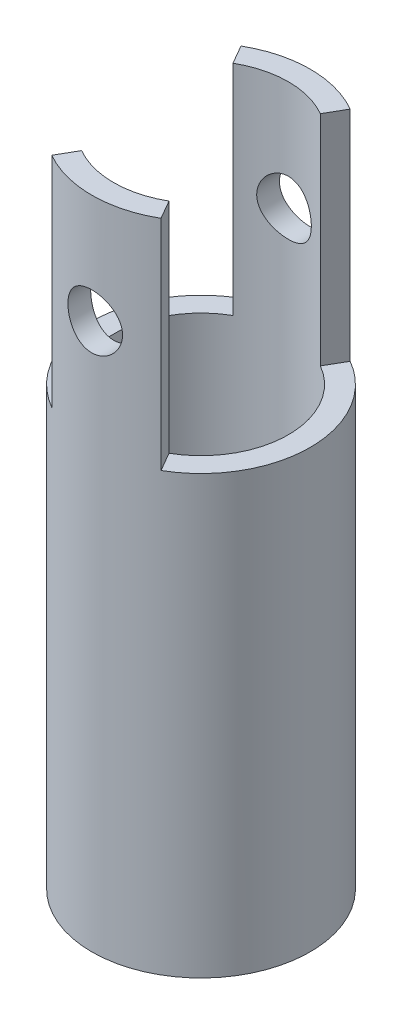
ISO-10303-21;
HEADER;
FILE_DESCRIPTION(('STEP AP214'),'2;1');
FILE_NAME('part.step','',(''),(''),'','','');
FILE_SCHEMA(('AUTOMOTIVE_DESIGN { 1 0 10303 214 1 1 1 1 }'));
ENDSEC;
DATA;
#1=APPLICATION_CONTEXT('core data for automotive mechanical design processes');
#2=APPLICATION_PROTOCOL_DEFINITION('international standard','automotive_design',2000,#1);
#3=PRODUCT_CONTEXT('',#1,'mechanical');
#4=PRODUCT('Part','Part','',(#3));
#5=PRODUCT_RELATED_PRODUCT_CATEGORY('part','',(#4));
#6=PRODUCT_DEFINITION_FORMATION('','',#4);
#7=PRODUCT_DEFINITION_CONTEXT('part definition',#1,'design');
#8=PRODUCT_DEFINITION('design','',#6,#7);
#9=PRODUCT_DEFINITION_SHAPE('','',#8);
#10=(LENGTH_UNIT() NAMED_UNIT(*) SI_UNIT(.MILLI.,.METRE.));
#11=(NAMED_UNIT(*) PLANE_ANGLE_UNIT() SI_UNIT($,.RADIAN.));
#12=(NAMED_UNIT(*) SI_UNIT($,.STERADIAN.) SOLID_ANGLE_UNIT());
#13=UNCERTAINTY_MEASURE_WITH_UNIT(LENGTH_MEASURE(1.E-05),#10,'distance_accuracy_value','');
#14=(GEOMETRIC_REPRESENTATION_CONTEXT(3) GLOBAL_UNCERTAINTY_ASSIGNED_CONTEXT((#13)) GLOBAL_UNIT_ASSIGNED_CONTEXT((#10,
#11,#12)) REPRESENTATION_CONTEXT('',''));
#15=CARTESIAN_POINT('',(0.,0.,0.));
#16=DIRECTION('',(0.,0.,1.));
#17=DIRECTION('',(1.,0.,0.));
#18=AXIS2_PLACEMENT_3D('',#15,#16,#17);
#19=CARTESIAN_POINT('',(0.,6.,0.));
#20=DIRECTION('',(0.,-1.,0.));
#21=DIRECTION('',(0.,0.,-1.));
#22=AXIS2_PLACEMENT_3D('',#19,#20,#21);
#23=CYLINDRICAL_SURFACE('',#22,1.);
#24=CARTESIAN_POINT('',(0.,0.,0.));
#25=DIRECTION('',(0.,1.,0.));
#26=DIRECTION('',(0.,0.,1.));
#27=AXIS2_PLACEMENT_3D('',#24,#25,#26);
#28=CIRCLE('',#27,1.);
#29=CARTESIAN_POINT('',(0.,0.,1.));
#30=VERTEX_POINT('',#29);
#31=EDGE_CURVE('E175',#30,#30,#28,.T.);
#32=ORIENTED_EDGE('',*,*,#31,.T.);
#33=EDGE_LOOP('',(#32));
#34=FACE_BOUND('',#33,.T.);
#35=CARTESIAN_POINT('',(0.,4.,0.));
#36=DIRECTION('',(0.,1.,0.));
#37=DIRECTION('',(0.,0.,1.));
#38=AXIS2_PLACEMENT_3D('',#35,#36,#37);
#39=CIRCLE('',#38,1.);
#40=CARTESIAN_POINT('',(0.500000000000001,4.,0.866025403784438));
#41=VERTEX_POINT('',#40);
#42=CARTESIAN_POINT('',(0.500000000000001,4.,-0.866025403784438));
#43=VERTEX_POINT('',#42);
#44=EDGE_CURVE('E127',#41,#43,#39,.T.);
#45=ORIENTED_EDGE('',*,*,#44,.F.);
#46=DIRECTION('',(0.,1.,0.));
#47=VECTOR('',#46,1.);
#48=CARTESIAN_POINT('',(0.500000000000001,4.,0.866025403784438));
#49=LINE('',#48,#47);
#50=CARTESIAN_POINT('',(0.500000000000001,6.,0.866025403784438));
#51=VERTEX_POINT('',#50);
#52=EDGE_CURVE('E135',#41,#51,#49,.T.);
#53=ORIENTED_EDGE('',*,*,#52,.T.);
#54=CARTESIAN_POINT('',(0.,6.,0.));
#55=DIRECTION('',(0.,1.,0.));
#56=DIRECTION('',(0.,0.,1.));
#57=AXIS2_PLACEMENT_3D('',#54,#55,#56);
#58=CIRCLE('',#57,1.);
#59=CARTESIAN_POINT('',(-0.500000000000001,6.,0.866025403784438));
#60=VERTEX_POINT('',#59);
#61=EDGE_CURVE('E179',#60,#51,#58,.T.);
#62=ORIENTED_EDGE('',*,*,#61,.F.);
#63=DIRECTION('',(0.,1.,0.));
#64=VECTOR('',#63,1.);
#65=CARTESIAN_POINT('',(-0.500000000000001,4.,0.866025403784438));
#66=LINE('',#65,#64);
#67=CARTESIAN_POINT('',(-0.500000000000001,4.,0.866025403784438));
#68=VERTEX_POINT('',#67);
#69=EDGE_CURVE('E167',#68,#60,#66,.T.);
#70=ORIENTED_EDGE('',*,*,#69,.F.);
#71=CARTESIAN_POINT('',(0.,4.,0.));
#72=DIRECTION('',(0.,1.,0.));
#73=DIRECTION('',(0.,0.,1.));
#74=AXIS2_PLACEMENT_3D('',#71,#72,#73);
#75=CIRCLE('',#74,1.);
#76=CARTESIAN_POINT('',(-0.500000000000001,4.,-0.866025403784438));
#77=VERTEX_POINT('',#76);
#78=EDGE_CURVE('E159',#77,#68,#75,.T.);
#79=ORIENTED_EDGE('',*,*,#78,.F.);
#80=DIRECTION('',(0.,1.,0.));
#81=VECTOR('',#80,1.);
#82=CARTESIAN_POINT('',(-0.500000000000001,4.,-0.866025403784438));
#83=LINE('',#82,#81);
#84=CARTESIAN_POINT('',(-0.500000000000001,6.,-0.866025403784438));
#85=VERTEX_POINT('',#84);
#86=EDGE_CURVE('E163',#77,#85,#83,.T.);
#87=ORIENTED_EDGE('',*,*,#86,.T.);
#88=CARTESIAN_POINT('',(0.500000000000001,6.,-0.866025403784438));
#89=VERTEX_POINT('',#88);
#90=EDGE_CURVE('E182',#89,#85,#58,.T.);
#91=ORIENTED_EDGE('',*,*,#90,.F.);
#92=DIRECTION('',(0.,1.,0.));
#93=VECTOR('',#92,1.);
#94=CARTESIAN_POINT('',(0.500000000000001,4.,-0.866025403784438));
#95=LINE('',#94,#93);
#96=EDGE_CURVE('E142',#43,#89,#95,.T.);
#97=ORIENTED_EDGE('',*,*,#96,.F.);
#98=EDGE_LOOP('',(#45,#53,#62,#70,#79,#87,#91,#97));
#99=FACE_BOUND('',#98,.T.);
#100=CARTESIAN_POINT('',(-0.25,5.,0.968245836551854));
#101=CARTESIAN_POINT('',(-0.249999607859675,4.9861949249108,0.968246100142962));
#102=CARTESIAN_POINT('',(-0.248852624552017,4.97238551014216,0.968544306248196));
#103=CARTESIAN_POINT('',(-0.244302312548611,4.94516324219185,0.969701862230623));
#104=CARTESIAN_POINT('',(-0.240897670674519,4.93175062455501,0.970561538685451));
#105=CARTESIAN_POINT('',(-0.231949119962409,4.90571964617804,0.97273872453253));
#106=CARTESIAN_POINT('',(-0.226407972785236,4.89310028446056,0.974055642673399));
#107=CARTESIAN_POINT('',(-0.213352114126352,4.86896891474688,0.976998192045818));
#108=CARTESIAN_POINT('',(-0.205837318856126,4.85745695379221,0.978623836383102));
#109=CARTESIAN_POINT('',(-0.188870842731129,4.83561383547354,0.982040716350921));
#110=CARTESIAN_POINT('',(-0.179383688770389,4.82531063996493,0.983834597621773));
#111=CARTESIAN_POINT('',(-0.158818206410081,4.80642386056403,0.987362875516555));
#112=CARTESIAN_POINT('',(-0.147739729418034,4.79784043743784,0.989097266566729));
#113=CARTESIAN_POINT('',(-0.124114520107891,4.78252245323685,0.992340415520238));
#114=CARTESIAN_POINT('',(-0.11154945761951,4.77581536118385,0.9938456874005));
#115=CARTESIAN_POINT('',(-0.0854263184292768,4.7646190355847,0.996430811926076));
#116=CARTESIAN_POINT('',(-0.0718683885791937,4.76012947480845,0.997510727334369));
#117=CARTESIAN_POINT('',(-0.0444358758754152,4.75358521654214,0.999104758848156));
#118=CARTESIAN_POINT('',(-0.0305732719548969,4.75148303556734,0.999629893844308));
#119=CARTESIAN_POINT('',(-0.00268288192627664,4.74962416207245,1.0000935941073));
#120=CARTESIAN_POINT('',(0.0113448794538072,4.74986712277904,1.00003224609671));
#121=CARTESIAN_POINT('',(0.038838061793097,4.75265748502501,0.999338094953533));
#122=CARTESIAN_POINT('',(0.0523090539002668,4.75515363250539,0.998718002340874));
#123=CARTESIAN_POINT('',(0.0786345618534216,4.76229712700485,0.996990836524855));
#124=CARTESIAN_POINT('',(0.0914890448426097,4.76694458853774,0.995883737398441));
#125=CARTESIAN_POINT('',(0.116351675875452,4.77830025706871,0.993287509700895));
#126=CARTESIAN_POINT('',(0.128351127441626,4.78502670446618,0.991795019695053));
#127=CARTESIAN_POINT('',(0.151068905585122,4.80033556791163,0.988589903809649));
#128=CARTESIAN_POINT('',(0.161787008771377,4.80891830685606,0.98687723965249));
#129=CARTESIAN_POINT('',(0.18194350877124,4.82797087419824,0.98336371376952));
#130=CARTESIAN_POINT('',(0.1913394197688,4.83848548923478,0.981561719525917));
#131=CARTESIAN_POINT('',(0.208244093990755,4.86095999735403,0.978115043516706));
#132=CARTESIAN_POINT('',(0.215752769011505,4.8729199579491,0.97647036910597));
#133=CARTESIAN_POINT('',(0.22869703225565,4.8980290034149,0.973520496831648));
#134=CARTESIAN_POINT('',(0.234122391742623,4.91118357303132,0.97221698372572));
#135=CARTESIAN_POINT('',(0.242671405159085,4.93825854680765,0.970118640139957));
#136=CARTESIAN_POINT('',(0.245795551638228,4.95217878639831,0.969323700810218));
#137=CARTESIAN_POINT('',(0.249582963866518,4.97999595015231,0.968355356039141));
#138=CARTESIAN_POINT('',(0.250309047391963,4.99388377933296,0.968166089093648));
#139=CARTESIAN_POINT('',(0.249451699051555,5.02158219365782,0.968387343481039));
#140=CARTESIAN_POINT('',(0.24786847978488,5.03539278579512,0.968797809601266));
#141=CARTESIAN_POINT('',(0.242492546393766,5.06231142649547,0.97015708195456));
#142=CARTESIAN_POINT('',(0.238736406828175,5.07542727265708,0.971096970234375));
#143=CARTESIAN_POINT('',(0.229161808167062,5.10084314578517,0.973400718270962));
#144=CARTESIAN_POINT('',(0.223343104771255,5.11314307590553,0.974764628248613));
#145=CARTESIAN_POINT('',(0.209677066793656,5.13684412778673,0.977796137093263));
#146=CARTESIAN_POINT('',(0.201792175383563,5.14822288400431,0.979469168606642));
#147=CARTESIAN_POINT('',(0.184265073233614,5.16951883628013,0.982917083071716));
#148=CARTESIAN_POINT('',(0.17462257370136,5.17943579166501,0.98469198272847));
#149=CARTESIAN_POINT('',(0.153565680246182,5.1977811042571,0.988197403031606));
#150=CARTESIAN_POINT('',(0.142112988132898,5.20616600625488,0.989925702061836));
#151=CARTESIAN_POINT('',(0.117925670673669,5.22089358669512,0.993097216613734));
#152=CARTESIAN_POINT('',(0.105191112239398,5.22723637166082,0.99454044700396));
#153=CARTESIAN_POINT('',(0.0788895504327728,5.23764460345279,0.996970115738314));
#154=CARTESIAN_POINT('',(0.0653293452569706,5.24172642843791,0.99795983002241));
#155=CARTESIAN_POINT('',(0.0376874400797021,5.24754603346084,0.999385293395788));
#156=CARTESIAN_POINT('',(0.0236058412603111,5.24928426587391,0.999821149393409));
#157=CARTESIAN_POINT('',(-0.00427088161083149,5.25034189739388,1.00008542352203));
#158=CARTESIAN_POINT('',(-0.0180634567415082,5.24972542727385,0.999929947200021));
#159=CARTESIAN_POINT('',(-0.0453418741036848,5.24623804317642,0.999064741143559));
#160=CARTESIAN_POINT('',(-0.0588277254452216,5.24336719624672,0.998355027892736));
#161=CARTESIAN_POINT('',(-0.085042758911204,5.23548694505727,0.996463582134908));
#162=CARTESIAN_POINT('',(-0.0977756236452547,5.23048913667134,0.995284411256671));
#163=CARTESIAN_POINT('',(-0.122229263260367,5.21850735524517,0.992578222283454));
#164=CARTESIAN_POINT('',(-0.133949910316263,5.21152313183261,0.991051160344318));
#165=CARTESIAN_POINT('',(-0.156350482105974,5.19557119150073,0.987768124203356));
#166=CARTESIAN_POINT('',(-0.166998747075146,5.18655996427316,0.986007542364116));
#167=CARTESIAN_POINT('',(-0.186653755067812,5.16689428700655,0.982476622633017));
#168=CARTESIAN_POINT('',(-0.195660081267044,5.15623942097552,0.98070628238106));
#169=CARTESIAN_POINT('',(-0.21194050661981,5.13334964644968,0.977318689651707));
#170=CARTESIAN_POINT('',(-0.219179154861648,5.12108896914688,0.975704909325977));
#171=CARTESIAN_POINT('',(-0.231481724153905,5.09548612751929,0.972859888875275));
#172=CARTESIAN_POINT('',(-0.236547227439889,5.08214475847318,0.971628370612036));
#173=CARTESIAN_POINT('',(-0.243605632141393,5.05735574704343,0.969879771853287));
#174=CARTESIAN_POINT('',(-0.245998292648957,5.04602670890441,0.969271657514403));
#175=CARTESIAN_POINT('',(-0.249195573143205,5.02313278274963,0.968454596450895));
#176=CARTESIAN_POINT('',(-0.25000032859263,5.01156791493734,0.968245615676597));
#177=CARTESIAN_POINT('',(-0.25,5.,0.968245836551854));
#178=B_SPLINE_CURVE_WITH_KNOTS('',3,(#100,#101,#102,#103,#104,#105,#106,#107,#108,#109,#110,
#111,#112,#113,#114,#115,#116,#117,#118,#119,#120,#121,#122,#123,#124,#125,#126,#127,#128,#129,
#130,#131,#132,#133,#134,#135,#136,#137,#138,#139,#140,#141,#142,#143,#144,#145,#146,#147,#148,
#149,#150,#151,#152,#153,#154,#155,#156,#157,#158,#159,#160,#161,#162,#163,#164,#165,#166,#167,
#168,#169,#170,#171,#172,#173,#174,#175,#176,#177),.UNSPECIFIED.,.T.,.F.,(4,2,2,2,2,2,2,2,2,2,2,
2,2,2,2,2,2,2,2,2,2,2,2,2,2,2,2,2,2,2,2,2,2,2,2,2,2,2,4),(0.,0.0413727441688085,
0.0827695741335529,0.124113072707288,0.165458326746165,0.207623954183663,0.249793521470553,
0.292551496388607,0.335303159837779,0.377188750986033,0.419068148656707,0.460018262679633,
0.500970556715472,0.542292874245131,0.5836223854596,0.626070466562599,0.66852053119049,
0.71117643199909,0.753823200120234,0.795343574752405,0.836860127174489,0.877697404999894,
0.918539521412104,0.960182845849844,1.00183301887573,1.04452533095601,1.08721541571024,
1.12959207279762,1.17196054889972,1.21318344611814,1.25440511736767,1.2954048765504,
1.33640980572876,1.37839709657276,1.4203950315562,1.46317647727536,1.50592672135731,
1.54059782716802,1.57526597509021),.UNSPECIFIED.);
#179=CARTESIAN_POINT('',(-0.25,5.,0.968245836551854));
#180=VERTEX_POINT('',#179);
#181=EDGE_CURVE('E213',#180,#180,#178,.T.);
#182=ORIENTED_EDGE('',*,*,#181,.F.);
#183=EDGE_LOOP('',(#182));
#184=FACE_BOUND('',#183,.T.);
#185=CARTESIAN_POINT('',(0.,5.25,-1.));
#186=CARTESIAN_POINT('',(0.0138126814449552,5.24999961237697,-0.999999766446688));
#187=CARTESIAN_POINT('',(0.027629692971794,5.24885140820437,-0.999710963553047));
#188=CARTESIAN_POINT('',(0.0548677206284222,5.2442958081155,-0.998586856383154));
#189=CARTESIAN_POINT('',(0.0682885078117899,5.24088713174369,-0.997751242366614));
#190=CARTESIAN_POINT('',(0.0943368120304296,5.23192679108965,-0.995626043886733));
#191=CARTESIAN_POINT('',(0.106965260571667,5.22637770021412,-0.994337004736811));
#192=CARTESIAN_POINT('',(0.131112021984071,5.21330310165919,-0.991442239679322));
#193=CARTESIAN_POINT('',(0.14263029739146,5.20577752731351,-0.989836503090084));
#194=CARTESIAN_POINT('',(0.164466987883487,5.18879986839096,-0.986445689319669));
#195=CARTESIAN_POINT('',(0.174759281676845,5.1793147375068,-0.984657845247555));
#196=CARTESIAN_POINT('',(0.193624821200551,5.15875796584851,-0.981122700195882));
#197=CARTESIAN_POINT('',(0.202197872824856,5.14768614617558,-0.979375403813914));
#198=CARTESIAN_POINT('',(0.217504423799839,5.12406746221043,-0.97609129283285));
#199=CARTESIAN_POINT('',(0.224208702654226,5.11150112819827,-0.974557990784342));
#200=CARTESIAN_POINT('',(0.235399484758421,5.08537526472361,-0.971915824687039));
#201=CARTESIAN_POINT('',(0.239886342573222,5.07181589444571,-0.970806892787981));
#202=CARTESIAN_POINT('',(0.246425806134049,5.04437608363292,-0.969167461195918));
#203=CARTESIAN_POINT('',(0.248525378055557,5.03050751732503,-0.968625818459043));
#204=CARTESIAN_POINT('',(0.250376962511309,5.00260523849767,-0.968148937562901));
#205=CARTESIAN_POINT('',(0.250129356969663,4.9885715532169,-0.96821360074774));
#206=CARTESIAN_POINT('',(0.24733108743988,4.96109736537592,-0.96893200916103));
#207=CARTESIAN_POINT('',(0.244836390031753,4.94765072975582,-0.969571438336465));
#208=CARTESIAN_POINT('',(0.237704031150518,4.92137315818145,-0.971344516127473));
#209=CARTESIAN_POINT('',(0.233066217011571,4.90854226616184,-0.972478199951161));
#210=CARTESIAN_POINT('',(0.221731579656192,4.88371033062466,-0.975125189840311));
#211=CARTESIAN_POINT('',(0.215014444538819,4.87171897136841,-0.976642212449035));
#212=CARTESIAN_POINT('',(0.199726046002492,4.84901354837386,-0.979882851410643));
#213=CARTESIAN_POINT('',(0.191154458134806,4.83829970865546,-0.981606503891225));
#214=CARTESIAN_POINT('',(0.172110570780203,4.8181327307176,-0.985126467566302));
#215=CARTESIAN_POINT('',(0.161591043027643,4.80872425165644,-0.986923449129952));
#216=CARTESIAN_POINT('',(0.139101986250617,4.79179645958935,-0.990343275964643));
#217=CARTESIAN_POINT('',(0.127132412951324,4.78427720428941,-0.991966115915692));
#218=CARTESIAN_POINT('',(0.102019314780232,4.77132490229594,-0.994862886823637));
#219=CARTESIAN_POINT('',(0.088871898868104,4.7658991099576,-0.996135600212875));
#220=CARTESIAN_POINT('',(0.0618126680238139,4.75734711571507,-0.998179861652364));
#221=CARTESIAN_POINT('',(0.0479009998584143,4.75422047393031,-0.998951505565468));
#222=CARTESIAN_POINT('',(0.0200899950650046,4.75042373907353,-0.999892498785624));
#223=CARTESIAN_POINT('',(0.00619945333136843,4.74969282898745,-1.00007675584713));
#224=CARTESIAN_POINT('',(-0.0215054791335846,4.75054150034258,-0.999864674690751));
#225=CARTESIAN_POINT('',(-0.0353198766074325,4.75212087379986,-0.999468388736411));
#226=CARTESIAN_POINT('',(-0.0622690447960818,4.75749515139856,-0.998149301878928));
#227=CARTESIAN_POINT('',(-0.0754108531614589,4.76125687724616,-0.997234390309685));
#228=CARTESIAN_POINT('',(-0.100876215408752,4.77085118067141,-0.994981177723557));
#229=CARTESIAN_POINT('',(-0.113199686505439,4.77668396738553,-0.99364283394982));
#230=CARTESIAN_POINT('',(-0.136920522404974,4.79037268814579,-0.990655513210517));
#231=CARTESIAN_POINT('',(-0.148297573639305,4.79826268539946,-0.989001445611553));
#232=CARTESIAN_POINT('',(-0.169587768940541,4.81579831813283,-0.985574181979032));
#233=CARTESIAN_POINT('',(-0.179500659828835,4.82544425660282,-0.983800965419508));
#234=CARTESIAN_POINT('',(-0.197831761345455,4.84650032680741,-0.980281594934618));
#235=CARTESIAN_POINT('',(-0.206207311270339,4.8579479505004,-0.978537173645468));
#236=CARTESIAN_POINT('',(-0.22091845983545,4.88212210574429,-0.975321463962064));
#237=CARTESIAN_POINT('',(-0.227254149026323,4.89484858049329,-0.973850163445043));
#238=CARTESIAN_POINT('',(-0.237658570101548,4.92115095373551,-0.971363491224442));
#239=CARTESIAN_POINT('',(-0.241740732775677,4.93472127139067,-0.970345425486509));
#240=CARTESIAN_POINT('',(-0.247557609992296,4.96238493964818,-0.968877906816972));
#241=CARTESIAN_POINT('',(-0.249292837913109,4.97647817517208,-0.968428329533227));
#242=CARTESIAN_POINT('',(-0.250339765055666,5.00435350397587,-0.968158168673261));
#243=CARTESIAN_POINT('',(-0.24971964963002,5.01813290585412,-0.968319887880439));
#244=CARTESIAN_POINT('',(-0.246229546385478,5.04538398144466,-0.969213181679738));
#245=CARTESIAN_POINT('',(-0.243359603781128,5.05885566133561,-0.969944744819761));
#246=CARTESIAN_POINT('',(-0.235488553240466,5.08503474317757,-0.971885434471204));
#247=CARTESIAN_POINT('',(-0.230500234113396,5.09774621754003,-0.973091692060516));
#248=CARTESIAN_POINT('',(-0.218544152267512,5.12216089711895,-0.975846259541381));
#249=CARTESIAN_POINT('',(-0.211576115005698,5.13386396219782,-0.977394616867955));
#250=CARTESIAN_POINT('',(-0.195644624772856,5.15625910483367,-0.980709390439187));
#251=CARTESIAN_POINT('',(-0.186633860485376,5.16691684557066,-0.982480441386262));
#252=CARTESIAN_POINT('',(-0.166964895198289,5.18659117413257,-0.98601337874381));
#253=CARTESIAN_POINT('',(-0.156306303543524,5.19560737168549,-0.987775262878433));
#254=CARTESIAN_POINT('',(-0.133411264450431,5.21190188476077,-0.991129426079438));
#255=CARTESIAN_POINT('',(-0.121149737052731,5.21914576894526,-0.99271805560978));
#256=CARTESIAN_POINT('',(-0.0955443432517457,5.23145791049009,-0.995508208291864));
#257=CARTESIAN_POINT('',(-0.0822012605727898,5.23652772677476,-0.996710008666302));
#258=CARTESIAN_POINT('',(-0.0574017088739119,5.24359530505494,-0.998413432609236));
#259=CARTESIAN_POINT('',(-0.0460633618180113,5.24599187384224,-0.999004308421151));
#260=CARTESIAN_POINT('',(-0.0231510119227137,5.24919432393699,-0.99979767538658));
#261=CARTESIAN_POINT('',(-0.0115770268737693,5.25000032488422,-1.00000019575149));
#262=CARTESIAN_POINT('',(0.,5.25,-1.));
#263=B_SPLINE_CURVE_WITH_KNOTS('',3,(#185,#186,#187,#188,#189,#190,#191,#192,#193,#194,#195,
#196,#197,#198,#199,#200,#201,#202,#203,#204,#205,#206,#207,#208,#209,#210,#211,#212,#213,#214,
#215,#216,#217,#218,#219,#220,#221,#222,#223,#224,#225,#226,#227,#228,#229,#230,#231,#232,#233,
#234,#235,#236,#237,#238,#239,#240,#241,#242,#243,#244,#245,#246,#247,#248,#249,#250,#251,#252,
#253,#254,#255,#256,#257,#258,#259,#260,#261,#262),.UNSPECIFIED.,.T.,.F.,(4,2,2,2,2,2,2,2,2,2,2,
2,2,2,2,2,2,2,2,2,2,2,2,2,2,2,2,2,2,2,2,2,2,2,2,2,2,2,4),(0.,0.041395618745315,
0.0828147062939834,0.124184150381018,0.165554990028221,0.207690725728565,0.24983121596677,
0.292597745909678,0.33535743528228,0.377260491832385,0.419156730187829,0.460037495011697,
0.500921172443397,0.542217546456466,0.583521151393605,0.626002501615033,0.668485149263745,
0.71111371501519,0.753734122814405,0.795263848248794,0.836789835187905,0.877700457523396,
0.918615212203818,0.960255979275587,1.0019039383467,1.04457418200746,1.08724253124918,
1.12965375769006,1.17205570542068,1.21323963399769,1.25442273492672,1.29536066759908,
1.33630428022817,1.37831596068318,1.42033761628403,1.46312030916598,1.50587227303558,
1.54057040490358,1.5752659267384),.UNSPECIFIED.);
#264=CARTESIAN_POINT('',(0.,5.25,-1.));
#265=VERTEX_POINT('',#264);
#266=EDGE_CURVE('E152',#265,#265,#263,.T.);
#267=ORIENTED_EDGE('',*,*,#266,.F.);
#268=EDGE_LOOP('',(#267));
#269=FACE_BOUND('',#268,.T.);
#270=ADVANCED_FACE('F54',(#34,#99,#184,#269),#23,.T.);
#271=CARTESIAN_POINT('',(0.,6.,0.));
#272=DIRECTION('',(0.,-1.,0.));
#273=DIRECTION('',(0.,0.,-1.));
#274=AXIS2_PLACEMENT_3D('',#271,#272,#273);
#275=CYLINDRICAL_SURFACE('',#274,0.8);
#276=CARTESIAN_POINT('',(-0.25,5.,0.759934207678533));
#277=CARTESIAN_POINT('',(-0.249999907560863,4.9863305927824,0.759934291986101));
#278=CARTESIAN_POINT('',(-0.24887507758624,4.97266024627195,0.760307063246376));
#279=CARTESIAN_POINT('',(-0.244418350805771,4.94572116783604,0.761751278234757));
#280=CARTESIAN_POINT('',(-0.241085857565507,4.93245254545588,0.762822910769838));
#281=CARTESIAN_POINT('',(-0.232339576446039,4.90671101960952,0.765531877608653));
#282=CARTESIAN_POINT('',(-0.226929471473064,4.89423675337777,0.767168210371662));
#283=CARTESIAN_POINT('',(-0.214193828346603,4.87036946082829,0.770820812454351));
#284=CARTESIAN_POINT('',(-0.206867951811343,4.85897662600827,0.772837148876294));
#285=CARTESIAN_POINT('',(-0.190239214124378,4.837204226501,0.777100255332483));
#286=CARTESIAN_POINT('',(-0.180881879944058,4.82686727811272,0.779352246768285));
#287=CARTESIAN_POINT('',(-0.160572409291121,4.80788079735825,0.783788491721947));
#288=CARTESIAN_POINT('',(-0.149620050503719,4.79923150061105,0.7859727357456));
#289=CARTESIAN_POINT('',(-0.126125182498666,4.78367778739773,0.790087106779803));
#290=CARTESIAN_POINT('',(-0.113552311304018,4.7768172592337,0.792010369125465));
#291=CARTESIAN_POINT('',(-0.0873608465706826,4.7653247900289,0.795325103666132));
#292=CARTESIAN_POINT('',(-0.0737424996974111,4.76069232517009,0.796716700839864));
#293=CARTESIAN_POINT('',(-0.0462928713932195,4.75392977438058,0.798774351641701));
#294=CARTESIAN_POINT('',(-0.0324811430936433,4.75172685004243,0.79946147796828));
#295=CARTESIAN_POINT('',(-0.00466816279690461,4.74965513071249,0.800107191752036));
#296=CARTESIAN_POINT('',(0.00933304539461623,4.74978580512823,0.80006594482013));
#297=CARTESIAN_POINT('',(0.0366148960709466,4.75232965831719,0.799274232265074));
#298=CARTESIAN_POINT('',(0.0499037268628085,4.7546638767026,0.798548301944321));
#299=CARTESIAN_POINT('',(0.0758906126695538,4.7614189980086,0.796498965121704));
#300=CARTESIAN_POINT('',(0.0885886290962388,4.76584003701731,0.795175519654244));
#301=CARTESIAN_POINT('',(0.113215620630956,4.77669403781498,0.79204691945909));
#302=CARTESIAN_POINT('',(0.125133281124566,4.78315096171261,0.790236067234006));
#303=CARTESIAN_POINT('',(0.147740502230406,4.79787421994091,0.786323445907032));
#304=CARTESIAN_POINT('',(0.158429751241767,4.80614101182756,0.784221603288827));
#305=CARTESIAN_POINT('',(0.178747539690776,4.82465472696026,0.779847341469648));
#306=CARTESIAN_POINT('',(0.188313309818837,4.83496981376825,0.77757146397952));
#307=CARTESIAN_POINT('',(0.205597948519073,4.85707902036488,0.773181230879473));
#308=CARTESIAN_POINT('',(0.213316599550676,4.86887331411494,0.771066894314638));
#309=CARTESIAN_POINT('',(0.226760930039538,4.89378349377203,0.767221693303059));
#310=CARTESIAN_POINT('',(0.232463361405391,4.90691268180869,0.765495380727824));
#311=CARTESIAN_POINT('',(0.241556691897,4.93401189837885,0.762675090658657));
#312=CARTESIAN_POINT('',(0.244948421531488,4.94798162284129,0.76158088599503));
#313=CARTESIAN_POINT('',(0.24920297037117,4.97576399051171,0.760199126852538));
#314=CARTESIAN_POINT('',(0.250161908707454,4.98956039924474,0.759880933031047));
#315=CARTESIAN_POINT('',(0.249793488996631,5.01711794829912,0.760002155178332));
#316=CARTESIAN_POINT('',(0.248466484222632,5.03087909374098,0.760441454083045));
#317=CARTESIAN_POINT('',(0.243649747026171,5.05756165933161,0.761997914901524));
#318=CARTESIAN_POINT('',(0.240223662321045,5.07049585481514,0.763095108186237));
#319=CARTESIAN_POINT('',(0.231380747322086,5.09560435839886,0.765822574680551));
#320=CARTESIAN_POINT('',(0.225963592342318,5.10777854218414,0.767452934829453));
#321=CARTESIAN_POINT('',(0.213115021311741,5.13140782195445,0.7711210793015));
#322=CARTESIAN_POINT('',(0.205630294977113,5.14283228311858,0.773169206978175));
#323=CARTESIAN_POINT('',(0.188921281735965,5.16429806927236,0.777420697946948));
#324=CARTESIAN_POINT('',(0.179696542938158,5.17433903378506,0.779624101471758));
#325=CARTESIAN_POINT('',(0.159314589550721,5.19318207318257,0.784048375124992));
#326=CARTESIAN_POINT('',(0.148093129957704,5.20191555722798,0.786266184571261));
#327=CARTESIAN_POINT('',(0.124290309130279,5.21737820866425,0.790378119687455));
#328=CARTESIAN_POINT('',(0.111709010221725,5.22410746786221,0.792272260181918));
#329=CARTESIAN_POINT('',(0.0856211046663666,5.23530611249434,0.795512623856998));
#330=CARTESIAN_POINT('',(0.0721220368567514,5.23979185756874,0.796862799122393));
#331=CARTESIAN_POINT('',(0.0445114508112782,5.24641450771794,0.79888048529716));
#332=CARTESIAN_POINT('',(0.0304001256680716,5.2485521478167,0.799548209828557));
#333=CARTESIAN_POINT('',(0.00259698732978019,5.25035820034992,0.800111606808921));
#334=CARTESIAN_POINT('',(-0.011087838389304,5.25012569003415,0.80003825881478));
#335=CARTESIAN_POINT('',(-0.0382146443846491,5.24743763779026,0.799201956162097));
#336=CARTESIAN_POINT('',(-0.0516566404359131,5.24498224080161,0.798439046465236));
#337=CARTESIAN_POINT('',(-0.0777510236961576,5.23798119815554,0.796319141689593));
#338=CARTESIAN_POINT('',(-0.0904111836898955,5.23346207843093,0.794969695920417));
#339=CARTESIAN_POINT('',(-0.114799685100017,5.2224858345583,0.791815891175894));
#340=CARTESIAN_POINT('',(-0.126527866254896,5.21602837800531,0.790011454182693));
#341=CARTESIAN_POINT('',(-0.149152338993938,5.20110544833111,0.786059793766775));
#342=CARTESIAN_POINT('',(-0.160006921410623,5.19257929550721,0.783903019502014));
#343=CARTESIAN_POINT('',(-0.180164158279863,5.1738680221113,0.779517473094032));
#344=CARTESIAN_POINT('',(-0.189466346700828,5.16368240517211,0.777288679569317));
#345=CARTESIAN_POINT('',(-0.206565731822509,5.14153685603179,0.772923785155223));
#346=CARTESIAN_POINT('',(-0.214302855989438,5.12952931937673,0.770793201728227));
#347=CARTESIAN_POINT('',(-0.227640941497027,5.10432037594612,0.766960250557748));
#348=CARTESIAN_POINT('',(-0.233242766807031,5.09111945470977,0.765257709717863));
#349=CARTESIAN_POINT('',(-0.24174236087164,5.06505547653723,0.762613120885147));
#350=CARTESIAN_POINT('',(-0.244829879675945,5.05225949051027,0.761618630103598));
#351=CARTESIAN_POINT('',(-0.248958491632,5.02630923358012,0.760279212948701));
#352=CARTESIAN_POINT('',(-0.250000088960817,5.01315505175754,0.759934126543309));
#353=CARTESIAN_POINT('',(-0.25,5.,0.759934207678533));
#354=B_SPLINE_CURVE_WITH_KNOTS('',3,(#276,#277,#278,#279,#280,#281,#282,#283,#284,#285,#286,
#287,#288,#289,#290,#291,#292,#293,#294,#295,#296,#297,#298,#299,#300,#301,#302,#303,#304,#305,
#306,#307,#308,#309,#310,#311,#312,#313,#314,#315,#316,#317,#318,#319,#320,#321,#322,#323,#324,
#325,#326,#327,#328,#329,#330,#331,#332,#333,#334,#335,#336,#337,#338,#339,#340,#341,#342,#343,
#344,#345,#346,#347,#348,#349,#350,#351,#352,#353),.UNSPECIFIED.,.T.,.F.,(4,2,2,2,2,2,2,2,2,2,2,
2,2,2,2,2,2,2,2,2,2,2,2,2,2,2,2,2,2,2,2,2,2,2,2,2,2,2,4),(0.,0.0409596275036467,
0.0819303254002394,0.122828728812009,0.163734360973282,0.205914161089969,0.248099845870538,
0.291239643915759,0.334369294824136,0.376167445659359,0.417956092931841,0.458301965927793,
0.498650470368479,0.53949280920511,0.580345485414667,0.62290067786296,0.665460879695845,
0.708496941857201,0.751517527893799,0.792809866557386,0.834095824412953,0.8741879440635,
0.914286604481194,0.955535226593996,0.996794575998534,1.0397638755978,1.08273120660895,
1.12538047855677,1.16801639625594,1.20887760485382,1.24973614935939,1.29008369300429,
1.33043815979808,1.37216138618521,1.41389711551916,1.45701559097818,1.50011660158242,
1.53954470871755,1.57896309835233),.UNSPECIFIED.);
#355=CARTESIAN_POINT('',(-0.25,5.,0.759934207678533));
#356=VERTEX_POINT('',#355);
#357=EDGE_CURVE('E193',#356,#356,#354,.T.);
#358=ORIENTED_EDGE('',*,*,#357,.T.);
#359=EDGE_LOOP('',(#358));
#360=FACE_BOUND('',#359,.T.);
#361=DIRECTION('',(0.,-1.,0.));
#362=VECTOR('',#361,1.);
#363=CARTESIAN_POINT('',(0.400000000000001,6.,0.69282032302755));
#364=LINE('',#363,#362);
#365=CARTESIAN_POINT('',(0.400000000000001,4.,0.69282032302755));
#366=VERTEX_POINT('',#365);
#367=CARTESIAN_POINT('',(0.400000000000001,6.,0.69282032302755));
#368=VERTEX_POINT('',#367);
#369=EDGE_CURVE('E12',#366,#368,#364,.F.);
#370=ORIENTED_EDGE('',*,*,#369,.F.);
#371=CARTESIAN_POINT('',(0.,4.,0.));
#372=DIRECTION('',(0.,1.,0.));
#373=DIRECTION('',(0.,0.,1.));
#374=AXIS2_PLACEMENT_3D('',#371,#372,#373);
#375=CIRCLE('',#374,0.8);
#376=CARTESIAN_POINT('',(0.400000000000001,4.,-0.69282032302755));
#377=VERTEX_POINT('',#376);
#378=EDGE_CURVE('E129',#366,#377,#375,.T.);
#379=ORIENTED_EDGE('',*,*,#378,.T.);
#380=DIRECTION('',(0.,-1.,0.));
#381=VECTOR('',#380,1.);
#382=CARTESIAN_POINT('',(0.400000000000001,6.,-0.69282032302755));
#383=LINE('',#382,#381);
#384=CARTESIAN_POINT('',(0.400000000000001,6.,-0.69282032302755));
#385=VERTEX_POINT('',#384);
#386=EDGE_CURVE('E68',#385,#377,#383,.T.);
#387=ORIENTED_EDGE('',*,*,#386,.F.);
#388=CARTESIAN_POINT('',(0.,6.,0.));
#389=DIRECTION('',(0.,1.,0.));
#390=DIRECTION('',(0.,0.,1.));
#391=AXIS2_PLACEMENT_3D('',#388,#389,#390);
#392=CIRCLE('',#391,0.8);
#393=CARTESIAN_POINT('',(-0.400000000000001,6.,-0.69282032302755));
#394=VERTEX_POINT('',#393);
#395=EDGE_CURVE('E176',#385,#394,#392,.T.);
#396=ORIENTED_EDGE('',*,*,#395,.T.);
#397=DIRECTION('',(0.,-1.,0.));
#398=VECTOR('',#397,1.);
#399=CARTESIAN_POINT('',(-0.400000000000001,6.,-0.69282032302755));
#400=LINE('',#399,#398);
#401=CARTESIAN_POINT('',(-0.400000000000001,4.,-0.69282032302755));
#402=VERTEX_POINT('',#401);
#403=EDGE_CURVE('E189',#394,#402,#400,.T.);
#404=ORIENTED_EDGE('',*,*,#403,.T.);
#405=CARTESIAN_POINT('',(0.,4.,0.));
#406=DIRECTION('',(0.,1.,0.));
#407=DIRECTION('',(0.,0.,1.));
#408=AXIS2_PLACEMENT_3D('',#405,#406,#407);
#409=CIRCLE('',#408,0.8);
#410=CARTESIAN_POINT('',(-0.400000000000001,4.,0.692820323027551));
#411=VERTEX_POINT('',#410);
#412=EDGE_CURVE('E181',#402,#411,#409,.T.);
#413=ORIENTED_EDGE('',*,*,#412,.T.);
#414=DIRECTION('',(0.,-1.,0.));
#415=VECTOR('',#414,1.);
#416=CARTESIAN_POINT('',(-0.400000000000001,6.,0.69282032302755));
#417=LINE('',#416,#415);
#418=CARTESIAN_POINT('',(-0.400000000000001,6.,0.692820323027551));
#419=VERTEX_POINT('',#418);
#420=EDGE_CURVE('E187',#419,#411,#417,.T.);
#421=ORIENTED_EDGE('',*,*,#420,.F.);
#422=EDGE_CURVE('E172',#419,#368,#392,.T.);
#423=ORIENTED_EDGE('',*,*,#422,.T.);
#424=EDGE_LOOP('',(#370,#379,#387,#396,#404,#413,#421,#423));
#425=FACE_BOUND('',#424,.T.);
#426=CARTESIAN_POINT('',(0.,0.,0.));
#427=DIRECTION('',(0.,1.,0.));
#428=DIRECTION('',(0.,0.,1.));
#429=AXIS2_PLACEMENT_3D('',#426,#427,#428);
#430=CIRCLE('',#429,0.8);
#431=CARTESIAN_POINT('',(0.,0.,0.8));
#432=VERTEX_POINT('',#431);
#433=EDGE_CURVE('E169',#432,#432,#430,.T.);
#434=ORIENTED_EDGE('',*,*,#433,.F.);
#435=EDGE_LOOP('',(#434));
#436=FACE_BOUND('',#435,.T.);
#437=CARTESIAN_POINT('',(0.,5.25,-0.8));
#438=CARTESIAN_POINT('',(0.0136878370349093,5.24999991068248,-0.79999993175598));
#439=CARTESIAN_POINT('',(0.0273766105005719,5.24887215461111,-0.799645389969689));
#440=CARTESIAN_POINT('',(0.0543538419176896,5.24440275169215,-0.798265788177606));
#441=CARTESIAN_POINT('',(0.0676422085451813,5.24106060372713,-0.797240576399691));
#442=CARTESIAN_POINT('',(0.0934257087301615,5.23228612576085,-0.794631631395846));
#443=CARTESIAN_POINT('',(0.105922035397161,5.2268570310694,-0.793048762998153));
#444=CARTESIAN_POINT('',(0.129826960469292,5.21407653646434,-0.789487938322082));
#445=CARTESIAN_POINT('',(0.141235387088975,5.2067248336439,-0.787509919799426));
#446=CARTESIAN_POINT('',(0.162993066990459,5.19006880159651,-0.78330042748096));
#447=CARTESIAN_POINT('',(0.173304005631341,5.18071582298773,-0.781063431855471));
#448=CARTESIAN_POINT('',(0.192239476407391,5.16042632151735,-0.776620092746924));
#449=CARTESIAN_POINT('',(0.200863694579709,5.14948950450131,-0.774413755041335));
#450=CARTESIAN_POINT('',(0.216388672966259,5.12601108723816,-0.770222289402061));
#451=CARTESIAN_POINT('',(0.223241568300377,5.11343650449371,-0.768243976625173));
#452=CARTESIAN_POINT('',(0.234719482153223,5.08724153700447,-0.764815603576892));
#453=CARTESIAN_POINT('',(0.239345087543442,5.07362142884436,-0.763365404176798));
#454=CARTESIAN_POINT('',(0.246096919859897,5.04615438450899,-0.761215214047346));
#455=CARTESIAN_POINT('',(0.248294220016529,5.03232663126603,-0.760493946146886));
#456=CARTESIAN_POINT('',(0.250349110074854,5.00448137621012,-0.759820110568225));
#457=CARTESIAN_POINT('',(0.250207321991544,4.99046392583248,-0.759867338530029));
#458=CARTESIAN_POINT('',(0.247643649465244,4.96322510794677,-0.760706378078571));
#459=CARTESIAN_POINT('',(0.245312115738703,4.94999417482784,-0.761468683472513));
#460=CARTESIAN_POINT('',(0.238581626711315,4.92412156869238,-0.763604051324364));
#461=CARTESIAN_POINT('',(0.234182451689118,4.9114799584582,-0.76497717869146));
#462=CARTESIAN_POINT('',(0.223377749362538,4.88692961111352,-0.768202088023286));
#463=CARTESIAN_POINT('',(0.216943851324159,4.87503427786161,-0.770060569320225));
#464=CARTESIAN_POINT('',(0.202272041475701,4.85246244642416,-0.774043713161564));
#465=CARTESIAN_POINT('',(0.194033661043156,4.84178626594926,-0.776168444789491));
#466=CARTESIAN_POINT('',(0.175543390836424,4.82144501131661,-0.780563055600579));
#467=CARTESIAN_POINT('',(0.165216914118564,4.81184808844406,-0.782835139211282));
#468=CARTESIAN_POINT('',(0.143072881619107,4.79450562128406,-0.78718314151927));
#469=CARTESIAN_POINT('',(0.131255215469805,4.78676021415616,-0.789259045676774));
#470=CARTESIAN_POINT('',(0.106332922093091,4.77329446227975,-0.793002589780353));
#471=CARTESIAN_POINT('',(0.093218981383856,4.76759037290721,-0.794666921296408));
#472=CARTESIAN_POINT('',(0.0661535955565289,4.75848939982969,-0.797375911657116));
#473=CARTESIAN_POINT('',(0.0522024061449216,4.75509181555232,-0.798420758650305));
#474=CARTESIAN_POINT('',(0.0244370314580688,4.7508163914842,-0.799742778790026));
#475=CARTESIAN_POINT('',(0.0106383697577684,4.7498462912813,-0.800048045790878));
#476=CARTESIAN_POINT('',(-0.0169260611465171,4.75019324532747,-0.799939599461962));
#477=CARTESIAN_POINT('',(-0.0306918348613013,4.75150996546452,-0.799525991162249));
#478=CARTESIAN_POINT('',(-0.0574438665951704,4.75631911852128,-0.798044727539543));
#479=CARTESIAN_POINT('',(-0.0704409956841895,4.7597566535225,-0.796993586221449));
#480=CARTESIAN_POINT('',(-0.095670385772273,4.76864287047334,-0.794360242758504));
#481=CARTESIAN_POINT('',(-0.107902552089803,4.77409180080498,-0.792777975028407));
#482=CARTESIAN_POINT('',(-0.131586481334446,4.78699464330976,-0.789197085519135));
#483=CARTESIAN_POINT('',(-0.143011947957591,4.79449419749944,-0.787189253636419));
#484=CARTESIAN_POINT('',(-0.164473170192019,4.8112306420234,-0.782986820005774));
#485=CARTESIAN_POINT('',(-0.174508547608667,4.82046800354862,-0.780792167691723));
#486=CARTESIAN_POINT('',(-0.193317492583931,4.84085177801074,-0.776353989770495));
#487=CARTESIAN_POINT('',(-0.202025304679547,4.85205933274905,-0.774111973428891));
#488=CARTESIAN_POINT('',(-0.217442500489818,4.87582532327415,-0.769923894175203));
#489=CARTESIAN_POINT('',(-0.224151915945048,4.88838373760089,-0.767977826562799));
#490=CARTESIAN_POINT('',(-0.235340166962282,4.91446903457717,-0.764623564721507));
#491=CARTESIAN_POINT('',(-0.239827639117771,4.92799192990094,-0.763213292936054));
#492=CARTESIAN_POINT('',(-0.246445788641927,4.95565449866476,-0.761102341882425));
#493=CARTESIAN_POINT('',(-0.24857736282922,4.96979393527426,-0.76040139260535));
#494=CARTESIAN_POINT('',(-0.250358812315081,4.99760081751085,-0.759816585424989));
#495=CARTESIAN_POINT('',(-0.250116559243914,5.01126069076259,-0.759897209366153));
#496=CARTESIAN_POINT('',(-0.247417636258948,5.03833491698384,-0.760780180944766));
#497=CARTESIAN_POINT('',(-0.244961069645118,5.0517492813768,-0.761582494914638));
#498=CARTESIAN_POINT('',(-0.237975459826756,5.07775880792036,-0.763793628316224));
#499=CARTESIAN_POINT('',(-0.233477284811888,5.0903630882192,-0.765193396366949));
#500=CARTESIAN_POINT('',(-0.222560454670128,5.11464808270627,-0.768439408522696));
#501=CARTESIAN_POINT('',(-0.216141408888508,5.12632860841554,-0.770285743433044));
#502=CARTESIAN_POINT('',(-0.20127135002695,5.14892919408811,-0.77430697406316));
#503=CARTESIAN_POINT('',(-0.192750667048254,5.15980162590009,-0.776491897844882));
#504=CARTESIAN_POINT('',(-0.174041799280969,5.17999726562236,-0.780897997643452));
#505=CARTESIAN_POINT('',(-0.163853168468881,5.1893200577982,-0.783119183213589));
#506=CARTESIAN_POINT('',(-0.141697332564666,5.2064565076726,-0.787434543904658));
#507=CARTESIAN_POINT('',(-0.129682914897476,5.21421094728999,-0.789522203461268));
#508=CARTESIAN_POINT('',(-0.10445582760273,5.22757978302789,-0.793253538593833));
#509=CARTESIAN_POINT('',(-0.0912436315590893,5.23319502042837,-0.794897388631664));
#510=CARTESIAN_POINT('',(-0.065149527074795,5.24171827352169,-0.797441301466923));
#511=CARTESIAN_POINT('',(-0.0523340674225087,5.24481497346107,-0.798392481612279));
#512=CARTESIAN_POINT('',(-0.0263459790880493,5.24895567199354,-0.799671800680971));
#513=CARTESIAN_POINT('',(-0.0131734232279348,5.2500000859608,-0.800000065679285));
#514=CARTESIAN_POINT('',(0.,5.25,-0.8));
#515=B_SPLINE_CURVE_WITH_KNOTS('',3,(#437,#438,#439,#440,#441,#442,#443,#444,#445,#446,#447,
#448,#449,#450,#451,#452,#453,#454,#455,#456,#457,#458,#459,#460,#461,#462,#463,#464,#465,#466,
#467,#468,#469,#470,#471,#472,#473,#474,#475,#476,#477,#478,#479,#480,#481,#482,#483,#484,#485,
#486,#487,#488,#489,#490,#491,#492,#493,#494,#495,#496,#497,#498,#499,#500,#501,#502,#503,#504,
#505,#506,#507,#508,#509,#510,#511,#512,#513,#514),.UNSPECIFIED.,.T.,.F.,(4,2,2,2,2,2,2,2,2,2,2,
2,2,2,2,2,2,2,2,2,2,2,2,2,2,2,2,2,2,2,2,2,2,2,2,2,2,2,4),(0.,0.041015089886502,
0.0820394646698134,0.123000495840487,0.163967984311679,0.206075644390318,0.248191134862553,
0.291347542494987,0.334492572559054,0.376338300326821,0.41817290057485,0.458353834828912,
0.498539039942699,0.539311285425664,0.58009413200529,0.622733494543774,0.66537601481118,
0.708350921364114,0.751312768973682,0.792615137081049,0.8339114712833,0.874181253430318,
0.914456010053574,0.955712649461261,0.996980491403093,1.03988355741085,1.082785941952,
1.12552023148664,1.16823824776944,1.20902440693668,1.24980866348674,1.28999582677792,
1.33019116864492,1.3719590279973,1.41373807473126,1.4568813362374,1.50000761331725,
1.53948927328766,1.57896294151067),.UNSPECIFIED.);
#516=CARTESIAN_POINT('',(0.,5.25,-0.8));
#517=VERTEX_POINT('',#516);
#518=EDGE_CURVE('E58',#517,#517,#515,.T.);
#519=ORIENTED_EDGE('',*,*,#518,.T.);
#520=EDGE_LOOP('',(#519));
#521=FACE_BOUND('',#520,.T.);
#522=ADVANCED_FACE('F198',(#360,#425,#436,#521),#275,.F.);
#523=CARTESIAN_POINT('',(0.,6.,0.));
#524=DIRECTION('',(0.,1.,0.));
#525=DIRECTION('',(0.,0.,1.));
#526=AXIS2_PLACEMENT_3D('',#523,#524,#525);
#527=PLANE('',#526);
#528=DIRECTION('',(0.500000000000001,0.,0.866025403784438));
#529=VECTOR('',#528,1.);
#530=CARTESIAN_POINT('',(0.,6.,0.));
#531=LINE('',#530,#529);
#532=EDGE_CURVE('E138',#368,#51,#531,.T.);
#533=ORIENTED_EDGE('',*,*,#532,.F.);
#534=ORIENTED_EDGE('',*,*,#422,.F.);
#535=DIRECTION('',(0.500000000000001,0.,-0.866025403784438));
#536=VECTOR('',#535,1.);
#537=CARTESIAN_POINT('',(0.,6.,0.));
#538=LINE('',#537,#536);
#539=EDGE_CURVE('E160',#60,#419,#538,.T.);
#540=ORIENTED_EDGE('',*,*,#539,.F.);
#541=ORIENTED_EDGE('',*,*,#61,.T.);
#542=EDGE_LOOP('',(#533,#534,#540,#541));
#543=FACE_BOUND('',#542,.T.);
#544=ADVANCED_FACE('F230',(#543),#527,.T.);
#545=DIRECTION('',(-0.500000000000001,0.,0.866025403784438));
#546=VECTOR('',#545,1.);
#547=CARTESIAN_POINT('',(0.,6.,0.));
#548=LINE('',#547,#546);
#549=EDGE_CURVE('E132',#89,#385,#548,.T.);
#550=ORIENTED_EDGE('',*,*,#549,.F.);
#551=ORIENTED_EDGE('',*,*,#90,.T.);
#552=DIRECTION('',(0.500000000000001,0.,0.866025403784438));
#553=VECTOR('',#552,1.);
#554=CARTESIAN_POINT('',(0.,6.,0.));
#555=LINE('',#554,#553);
#556=EDGE_CURVE('E154',#85,#394,#555,.T.);
#557=ORIENTED_EDGE('',*,*,#556,.T.);
#558=ORIENTED_EDGE('',*,*,#395,.F.);
#559=EDGE_LOOP('',(#550,#551,#557,#558));
#560=FACE_BOUND('',#559,.T.);
#561=ADVANCED_FACE('F238',(#560),#527,.T.);
#562=CARTESIAN_POINT('',(0.,0.,0.));
#563=DIRECTION('',(0.,1.,0.));
#564=DIRECTION('',(0.,0.,1.));
#565=AXIS2_PLACEMENT_3D('',#562,#563,#564);
#566=PLANE('',#565);
#567=ORIENTED_EDGE('',*,*,#31,.F.);
#568=EDGE_LOOP('',(#567));
#569=FACE_BOUND('',#568,.T.);
#570=ORIENTED_EDGE('',*,*,#433,.T.);
#571=EDGE_LOOP('',(#570));
#572=FACE_BOUND('',#571,.T.);
#573=ADVANCED_FACE('F234',(#569,#572),#566,.F.);
#574=CARTESIAN_POINT('',(0.,4.,0.));
#575=DIRECTION('',(-0.866025403784438,0.,0.500000000000001));
#576=DIRECTION('',(0.500000000000001,0.,0.866025403784438));
#577=AXIS2_PLACEMENT_3D('',#574,#575,#576);
#578=PLANE('',#577);
#579=ORIENTED_EDGE('',*,*,#556,.F.);
#580=ORIENTED_EDGE('',*,*,#86,.F.);
#581=DIRECTION('',(0.500000000000001,0.,0.866025403784438));
#582=VECTOR('',#581,1.);
#583=CARTESIAN_POINT('',(0.,4.,0.));
#584=LINE('',#583,#582);
#585=EDGE_CURVE('E156',#77,#402,#584,.T.);
#586=ORIENTED_EDGE('',*,*,#585,.T.);
#587=ORIENTED_EDGE('',*,*,#403,.F.);
#588=EDGE_LOOP('',(#579,#580,#586,#587));
#589=FACE_BOUND('',#588,.T.);
#590=ADVANCED_FACE('F237',(#589),#578,.T.);
#591=CARTESIAN_POINT('',(0.,4.,0.));
#592=DIRECTION('',(0.866025403784438,0.,0.500000000000001));
#593=DIRECTION('',(0.500000000000001,0.,-0.866025403784438));
#594=AXIS2_PLACEMENT_3D('',#591,#592,#593);
#595=PLANE('',#594);
#596=ORIENTED_EDGE('',*,*,#420,.T.);
#597=DIRECTION('',(0.500000000000001,0.,-0.866025403784438));
#598=VECTOR('',#597,1.);
#599=CARTESIAN_POINT('',(0.,4.,0.));
#600=LINE('',#599,#598);
#601=EDGE_CURVE('E84',#68,#411,#600,.T.);
#602=ORIENTED_EDGE('',*,*,#601,.F.);
#603=ORIENTED_EDGE('',*,*,#69,.T.);
#604=ORIENTED_EDGE('',*,*,#539,.T.);
#605=EDGE_LOOP('',(#596,#602,#603,#604));
#606=FACE_BOUND('',#605,.T.);
#607=ADVANCED_FACE('F248',(#606),#595,.F.);
#608=CARTESIAN_POINT('',(0.,4.,0.));
#609=DIRECTION('',(0.,1.,0.));
#610=DIRECTION('',(0.,0.,1.));
#611=AXIS2_PLACEMENT_3D('',#608,#609,#610);
#612=PLANE('',#611);
#613=ORIENTED_EDGE('',*,*,#585,.F.);
#614=ORIENTED_EDGE('',*,*,#78,.T.);
#615=ORIENTED_EDGE('',*,*,#601,.T.);
#616=ORIENTED_EDGE('',*,*,#412,.F.);
#617=EDGE_LOOP('',(#613,#614,#615,#616));
#618=FACE_BOUND('',#617,.T.);
#619=ADVANCED_FACE('F264',(#618),#612,.T.);
#620=CARTESIAN_POINT('',(0.,4.,0.));
#621=DIRECTION('',(-0.866025403784438,0.,0.500000000000001));
#622=DIRECTION('',(0.500000000000001,0.,0.866025403784438));
#623=AXIS2_PLACEMENT_3D('',#620,#621,#622);
#624=PLANE('',#623);
#625=ORIENTED_EDGE('',*,*,#369,.T.);
#626=ORIENTED_EDGE('',*,*,#532,.T.);
#627=ORIENTED_EDGE('',*,*,#52,.F.);
#628=DIRECTION('',(0.500000000000001,0.,0.866025403784438));
#629=VECTOR('',#628,1.);
#630=CARTESIAN_POINT('',(0.,4.,0.));
#631=LINE('',#630,#629);
#632=EDGE_CURVE('E123',#366,#41,#631,.T.);
#633=ORIENTED_EDGE('',*,*,#632,.F.);
#634=EDGE_LOOP('',(#625,#626,#627,#633));
#635=FACE_BOUND('',#634,.T.);
#636=ADVANCED_FACE('F136',(#635),#624,.F.);
#637=CARTESIAN_POINT('',(0.,4.,0.));
#638=DIRECTION('',(-0.866025403784438,0.,-0.500000000000001));
#639=DIRECTION('',(-0.500000000000001,0.,0.866025403784438));
#640=AXIS2_PLACEMENT_3D('',#637,#638,#639);
#641=PLANE('',#640);
#642=ORIENTED_EDGE('',*,*,#386,.T.);
#643=DIRECTION('',(-0.500000000000001,0.,0.866025403784438));
#644=VECTOR('',#643,1.);
#645=CARTESIAN_POINT('',(0.,4.,0.));
#646=LINE('',#645,#644);
#647=EDGE_CURVE('E76',#43,#377,#646,.T.);
#648=ORIENTED_EDGE('',*,*,#647,.F.);
#649=ORIENTED_EDGE('',*,*,#96,.T.);
#650=ORIENTED_EDGE('',*,*,#549,.T.);
#651=EDGE_LOOP('',(#642,#648,#649,#650));
#652=FACE_BOUND('',#651,.T.);
#653=ADVANCED_FACE('F268',(#652),#641,.F.);
#654=CARTESIAN_POINT('',(0.,4.,0.));
#655=DIRECTION('',(0.,1.,0.));
#656=DIRECTION('',(0.,0.,1.));
#657=AXIS2_PLACEMENT_3D('',#654,#655,#656);
#658=PLANE('',#657);
#659=ORIENTED_EDGE('',*,*,#632,.T.);
#660=ORIENTED_EDGE('',*,*,#44,.T.);
#661=ORIENTED_EDGE('',*,*,#647,.T.);
#662=ORIENTED_EDGE('',*,*,#378,.F.);
#663=EDGE_LOOP('',(#659,#660,#661,#662));
#664=FACE_BOUND('',#663,.T.);
#665=ADVANCED_FACE('F125',(#664),#658,.T.);
#666=CARTESIAN_POINT('',(0.,5.,2.));
#667=DIRECTION('',(0.,0.,-1.));
#668=DIRECTION('',(-1.,0.,0.));
#669=AXIS2_PLACEMENT_3D('',#666,#667,#668);
#670=CYLINDRICAL_SURFACE('',#669,0.25);
#671=ORIENTED_EDGE('',*,*,#357,.F.);
#672=EDGE_LOOP('',(#671));
#673=FACE_BOUND('',#672,.T.);
#674=ORIENTED_EDGE('',*,*,#181,.T.);
#675=EDGE_LOOP('',(#674));
#676=FACE_BOUND('',#675,.T.);
#677=ADVANCED_FACE('F206',(#673,#676),#670,.F.);
#678=ORIENTED_EDGE('',*,*,#518,.F.);
#679=EDGE_LOOP('',(#678));
#680=FACE_BOUND('',#679,.T.);
#681=ORIENTED_EDGE('',*,*,#266,.T.);
#682=EDGE_LOOP('',(#681));
#683=FACE_BOUND('',#682,.T.);
#684=ADVANCED_FACE('F202',(#680,#683),#670,.F.);
#685=CLOSED_SHELL('',(#270,#522,#544,#561,#573,#590,#607,#619,#636,#653,#665,#677,#684));
#686=MANIFOLD_SOLID_BREP('B2',#685);
#687=ADVANCED_BREP_SHAPE_REPRESENTATION('',(#18,#686),#14);
#688=SHAPE_DEFINITION_REPRESENTATION(#9,#687);
ENDSEC;
END-ISO-10303-21;
